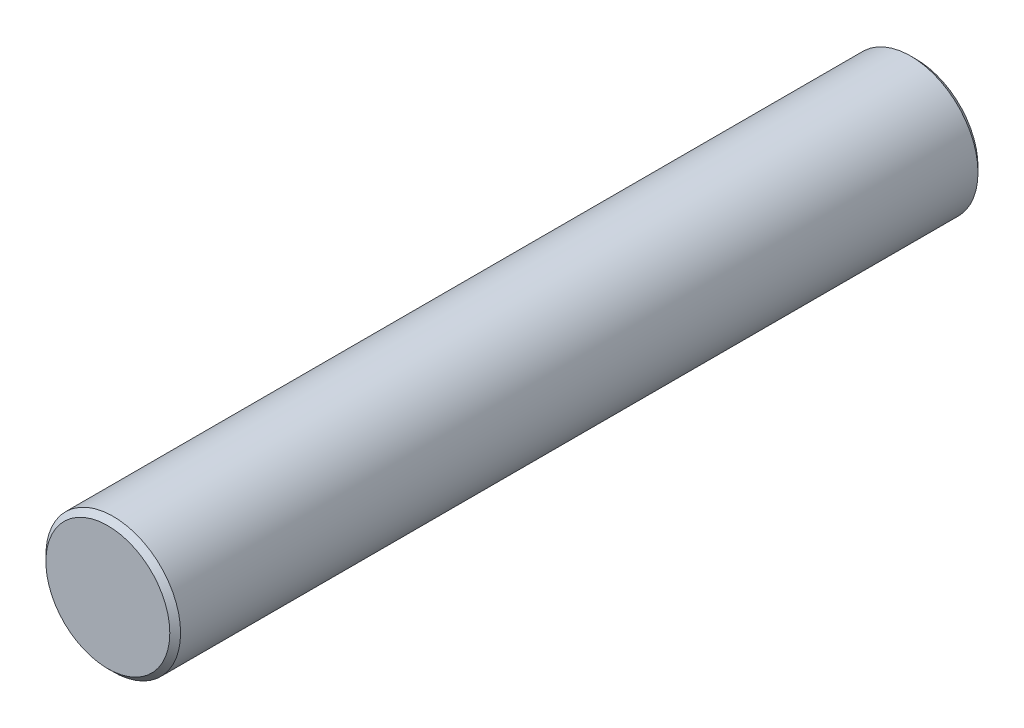
ISO-10303-21;
HEADER;
FILE_DESCRIPTION(('STEP AP214'),'2;1');
FILE_NAME('part.step','',(''),(''),'','','');
FILE_SCHEMA(('AUTOMOTIVE_DESIGN { 1 0 10303 214 1 1 1 1 }'));
ENDSEC;
DATA;
#1=APPLICATION_CONTEXT('core data for automotive mechanical design processes');
#2=APPLICATION_PROTOCOL_DEFINITION('international standard','automotive_design',2000,#1);
#3=PRODUCT_CONTEXT('',#1,'mechanical');
#4=PRODUCT('Part','Part','',(#3));
#5=PRODUCT_RELATED_PRODUCT_CATEGORY('part','',(#4));
#6=PRODUCT_DEFINITION_FORMATION('','',#4);
#7=PRODUCT_DEFINITION_CONTEXT('part definition',#1,'design');
#8=PRODUCT_DEFINITION('design','',#6,#7);
#9=PRODUCT_DEFINITION_SHAPE('','',#8);
#10=(LENGTH_UNIT() NAMED_UNIT(*) SI_UNIT(.MILLI.,.METRE.));
#11=(NAMED_UNIT(*) PLANE_ANGLE_UNIT() SI_UNIT($,.RADIAN.));
#12=(NAMED_UNIT(*) SI_UNIT($,.STERADIAN.) SOLID_ANGLE_UNIT());
#13=UNCERTAINTY_MEASURE_WITH_UNIT(LENGTH_MEASURE(1.E-05),#10,'distance_accuracy_value','');
#14=(GEOMETRIC_REPRESENTATION_CONTEXT(3) GLOBAL_UNCERTAINTY_ASSIGNED_CONTEXT((#13)) GLOBAL_UNIT_ASSIGNED_CONTEXT((#10,
#11,#12)) REPRESENTATION_CONTEXT('',''));
#15=CARTESIAN_POINT('',(0.,0.,0.));
#16=DIRECTION('',(0.,0.,1.));
#17=DIRECTION('',(1.,0.,0.));
#18=AXIS2_PLACEMENT_3D('',#15,#16,#17);
#19=CARTESIAN_POINT('',(0.,0.,30.));
#20=DIRECTION('',(0.,0.,-1.));
#21=DIRECTION('',(-1.,0.,0.));
#22=AXIS2_PLACEMENT_3D('',#19,#20,#21);
#23=CYLINDRICAL_SURFACE('',#22,2.5);
#24=CARTESIAN_POINT('',(0.,0.,29.8));
#25=DIRECTION('',(0.,0.,1.));
#26=DIRECTION('',(1.,0.,0.));
#27=AXIS2_PLACEMENT_3D('',#24,#25,#26);
#28=CIRCLE('',#27,2.5);
#29=CARTESIAN_POINT('',(2.5,0.,29.8));
#30=VERTEX_POINT('',#29);
#31=EDGE_CURVE('E48',#30,#30,#28,.F.);
#32=ORIENTED_EDGE('',*,*,#31,.T.);
#33=EDGE_LOOP('',(#32));
#34=FACE_BOUND('',#33,.T.);
#35=CARTESIAN_POINT('',(0.,0.,0.199999999999999));
#36=DIRECTION('',(0.,0.,1.));
#37=DIRECTION('',(1.,0.,0.));
#38=AXIS2_PLACEMENT_3D('',#35,#36,#37);
#39=CIRCLE('',#38,2.5);
#40=CARTESIAN_POINT('',(2.5,0.,0.199999999999999));
#41=VERTEX_POINT('',#40);
#42=EDGE_CURVE('E53',#41,#41,#39,.T.);
#43=ORIENTED_EDGE('',*,*,#42,.T.);
#44=EDGE_LOOP('',(#43));
#45=FACE_BOUND('',#44,.T.);
#46=ADVANCED_FACE('F39',(#34,#45),#23,.T.);
#47=CARTESIAN_POINT('',(0.,0.,30.));
#48=DIRECTION('',(0.,0.,1.));
#49=DIRECTION('',(1.,0.,0.));
#50=AXIS2_PLACEMENT_3D('',#47,#48,#49);
#51=PLANE('',#50);
#52=CARTESIAN_POINT('',(0.,0.,30.));
#53=DIRECTION('',(0.,0.,1.));
#54=DIRECTION('',(1.,0.,0.));
#55=AXIS2_PLACEMENT_3D('',#52,#53,#54);
#56=CIRCLE('',#55,2.3);
#57=CARTESIAN_POINT('',(2.3,0.,30.));
#58=VERTEX_POINT('',#57);
#59=EDGE_CURVE('E58',#58,#58,#56,.T.);
#60=ORIENTED_EDGE('',*,*,#59,.T.);
#61=EDGE_LOOP('',(#60));
#62=FACE_BOUND('',#61,.T.);
#63=ADVANCED_FACE('F65',(#62),#51,.T.);
#64=CARTESIAN_POINT('',(0.,0.,0.));
#65=DIRECTION('',(0.,0.,1.));
#66=DIRECTION('',(1.,0.,0.));
#67=AXIS2_PLACEMENT_3D('',#64,#65,#66);
#68=PLANE('',#67);
#69=CARTESIAN_POINT('',(0.,0.,0.));
#70=DIRECTION('',(0.,0.,1.));
#71=DIRECTION('',(1.,0.,0.));
#72=AXIS2_PLACEMENT_3D('',#69,#70,#71);
#73=CIRCLE('',#72,2.3);
#74=CARTESIAN_POINT('',(2.3,0.,0.));
#75=VERTEX_POINT('',#74);
#76=EDGE_CURVE('E10',#75,#75,#73,.F.);
#77=ORIENTED_EDGE('',*,*,#76,.T.);
#78=EDGE_LOOP('',(#77));
#79=FACE_BOUND('',#78,.T.);
#80=ADVANCED_FACE('F69',(#79),#68,.F.);
#81=CARTESIAN_POINT('',(0.,0.,30.));
#82=DIRECTION('',(0.,0.,-1.));
#83=DIRECTION('',(-1.,0.,0.));
#84=AXIS2_PLACEMENT_3D('',#81,#82,#83);
#85=CONICAL_SURFACE('',#84,2.3,0.78539816339745);
#86=ORIENTED_EDGE('',*,*,#31,.F.);
#87=EDGE_LOOP('',(#86));
#88=FACE_BOUND('',#87,.T.);
#89=ORIENTED_EDGE('',*,*,#59,.F.);
#90=EDGE_LOOP('',(#89));
#91=FACE_BOUND('',#90,.T.);
#92=ADVANCED_FACE('F67',(#88,#91),#85,.T.);
#93=CARTESIAN_POINT('',(0.,0.,0.199999999999999));
#94=DIRECTION('',(0.,0.,1.));
#95=DIRECTION('',(1.,0.,0.));
#96=AXIS2_PLACEMENT_3D('',#93,#94,#95);
#97=CONICAL_SURFACE('',#96,2.5,0.78539816339745);
#98=ORIENTED_EDGE('',*,*,#76,.F.);
#99=EDGE_LOOP('',(#98));
#100=FACE_BOUND('',#99,.T.);
#101=ORIENTED_EDGE('',*,*,#42,.F.);
#102=EDGE_LOOP('',(#101));
#103=FACE_BOUND('',#102,.T.);
#104=ADVANCED_FACE('F42',(#100,#103),#97,.T.);
#105=CLOSED_SHELL('',(#46,#63,#80,#92,#104));
#106=MANIFOLD_SOLID_BREP('B2',#105);
#107=ADVANCED_BREP_SHAPE_REPRESENTATION('',(#18,#106),#14);
#108=SHAPE_DEFINITION_REPRESENTATION(#9,#107);
ENDSEC;
END-ISO-10303-21;
